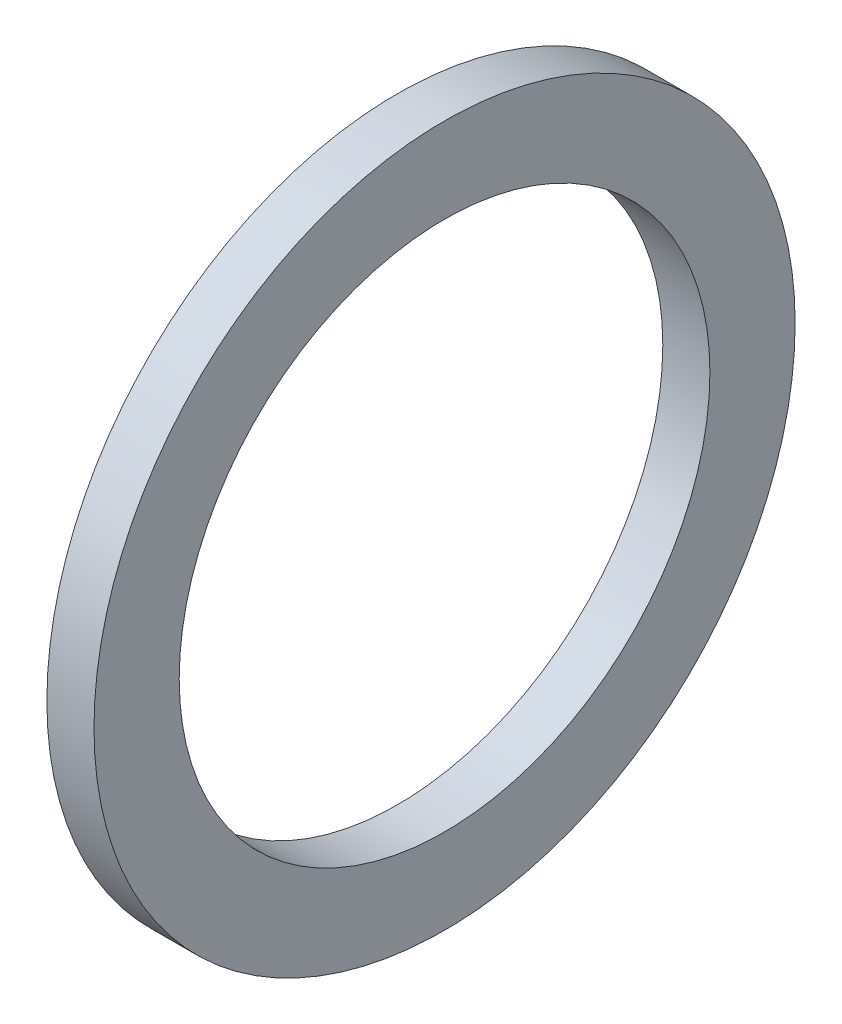
ISO-10303-21;
HEADER;
FILE_DESCRIPTION(('STEP AP214'),'2;1');
FILE_NAME('part.step','',(''),(''),'','','');
FILE_SCHEMA(('AUTOMOTIVE_DESIGN { 1 0 10303 214 1 1 1 1 }'));
ENDSEC;
DATA;
#1=APPLICATION_CONTEXT('core data for automotive mechanical design processes');
#2=APPLICATION_PROTOCOL_DEFINITION('international standard','automotive_design',2000,#1);
#3=PRODUCT_CONTEXT('',#1,'mechanical');
#4=PRODUCT('Part','Part','',(#3));
#5=PRODUCT_RELATED_PRODUCT_CATEGORY('part','',(#4));
#6=PRODUCT_DEFINITION_FORMATION('','',#4);
#7=PRODUCT_DEFINITION_CONTEXT('part definition',#1,'design');
#8=PRODUCT_DEFINITION('design','',#6,#7);
#9=PRODUCT_DEFINITION_SHAPE('','',#8);
#10=(LENGTH_UNIT() NAMED_UNIT(*) SI_UNIT(.MILLI.,.METRE.));
#11=(NAMED_UNIT(*) PLANE_ANGLE_UNIT() SI_UNIT($,.RADIAN.));
#12=(NAMED_UNIT(*) SI_UNIT($,.STERADIAN.) SOLID_ANGLE_UNIT());
#13=UNCERTAINTY_MEASURE_WITH_UNIT(LENGTH_MEASURE(1.E-05),#10,'distance_accuracy_value','');
#14=(GEOMETRIC_REPRESENTATION_CONTEXT(3) GLOBAL_UNCERTAINTY_ASSIGNED_CONTEXT((#13)) GLOBAL_UNIT_ASSIGNED_CONTEXT((#10,
#11,#12)) REPRESENTATION_CONTEXT('',''));
#15=CARTESIAN_POINT('',(0.,0.,0.));
#16=DIRECTION('',(0.,0.,1.));
#17=DIRECTION('',(1.,0.,0.));
#18=AXIS2_PLACEMENT_3D('',#15,#16,#17);
#19=CARTESIAN_POINT('',(0.8636,0.,0.));
#20=DIRECTION('',(1.,0.,0.));
#21=DIRECTION('',(0.,0.,-1.));
#22=AXIS2_PLACEMENT_3D('',#19,#20,#21);
#23=PLANE('',#22);
#24=CARTESIAN_POINT('',(0.8636,0.,0.));
#25=DIRECTION('',(1.,0.,0.));
#26=DIRECTION('',(0.,0.,-1.));
#27=AXIS2_PLACEMENT_3D('',#24,#25,#26);
#28=CIRCLE('',#27,6.4262);
#29=CARTESIAN_POINT('',(0.8636,0.,-6.4262));
#30=VERTEX_POINT('',#29);
#31=EDGE_CURVE('E10',#30,#30,#28,.T.);
#32=ORIENTED_EDGE('',*,*,#31,.T.);
#33=EDGE_LOOP('',(#32));
#34=FACE_BOUND('',#33,.T.);
#35=CARTESIAN_POINT('',(0.8636,0.,0.));
#36=DIRECTION('',(1.,0.,0.));
#37=DIRECTION('',(0.,0.,-1.));
#38=AXIS2_PLACEMENT_3D('',#35,#36,#37);
#39=CIRCLE('',#38,4.8641);
#40=CARTESIAN_POINT('',(0.8636,0.,-4.8641));
#41=VERTEX_POINT('',#40);
#42=EDGE_CURVE('E41',#41,#41,#39,.T.);
#43=ORIENTED_EDGE('',*,*,#42,.F.);
#44=EDGE_LOOP('',(#43));
#45=FACE_BOUND('',#44,.T.);
#46=ADVANCED_FACE('F30',(#34,#45),#23,.T.);
#47=CARTESIAN_POINT('',(0.,0.,0.));
#48=DIRECTION('',(1.,0.,0.));
#49=DIRECTION('',(0.,0.,-1.));
#50=AXIS2_PLACEMENT_3D('',#47,#48,#49);
#51=PLANE('',#50);
#52=CARTESIAN_POINT('',(0.,0.,0.));
#53=DIRECTION('',(1.,0.,0.));
#54=DIRECTION('',(0.,0.,-1.));
#55=AXIS2_PLACEMENT_3D('',#52,#53,#54);
#56=CIRCLE('',#55,6.4262);
#57=CARTESIAN_POINT('',(0.,0.,-6.4262));
#58=VERTEX_POINT('',#57);
#59=EDGE_CURVE('E34',#58,#58,#56,.T.);
#60=ORIENTED_EDGE('',*,*,#59,.F.);
#61=EDGE_LOOP('',(#60));
#62=FACE_BOUND('',#61,.T.);
#63=CARTESIAN_POINT('',(0.,0.,0.));
#64=DIRECTION('',(1.,0.,0.));
#65=DIRECTION('',(0.,0.,-1.));
#66=AXIS2_PLACEMENT_3D('',#63,#64,#65);
#67=CIRCLE('',#66,4.8641);
#68=CARTESIAN_POINT('',(0.,0.,-4.8641));
#69=VERTEX_POINT('',#68);
#70=EDGE_CURVE('E43',#69,#69,#67,.T.);
#71=ORIENTED_EDGE('',*,*,#70,.T.);
#72=EDGE_LOOP('',(#71));
#73=FACE_BOUND('',#72,.T.);
#74=ADVANCED_FACE('F53',(#62,#73),#51,.F.);
#75=CARTESIAN_POINT('',(0.8636,0.,0.));
#76=DIRECTION('',(-1.,0.,0.));
#77=DIRECTION('',(0.,0.,1.));
#78=AXIS2_PLACEMENT_3D('',#75,#76,#77);
#79=CYLINDRICAL_SURFACE('',#78,6.4262);
#80=ORIENTED_EDGE('',*,*,#31,.F.);
#81=EDGE_LOOP('',(#80));
#82=FACE_BOUND('',#81,.T.);
#83=ORIENTED_EDGE('',*,*,#59,.T.);
#84=EDGE_LOOP('',(#83));
#85=FACE_BOUND('',#84,.T.);
#86=ADVANCED_FACE('F32',(#82,#85),#79,.T.);
#87=CARTESIAN_POINT('',(0.8636,0.,0.));
#88=DIRECTION('',(-1.,0.,0.));
#89=DIRECTION('',(0.,0.,1.));
#90=AXIS2_PLACEMENT_3D('',#87,#88,#89);
#91=CYLINDRICAL_SURFACE('',#90,4.8641);
#92=ORIENTED_EDGE('',*,*,#42,.T.);
#93=EDGE_LOOP('',(#92));
#94=FACE_BOUND('',#93,.T.);
#95=ORIENTED_EDGE('',*,*,#70,.F.);
#96=EDGE_LOOP('',(#95));
#97=FACE_BOUND('',#96,.T.);
#98=ADVANCED_FACE('F49',(#94,#97),#91,.F.);
#99=CLOSED_SHELL('',(#46,#74,#86,#98));
#100=MANIFOLD_SOLID_BREP('B2',#99);
#101=ADVANCED_BREP_SHAPE_REPRESENTATION('',(#18,#100),#14);
#102=SHAPE_DEFINITION_REPRESENTATION(#9,#101);
ENDSEC;
END-ISO-10303-21;
